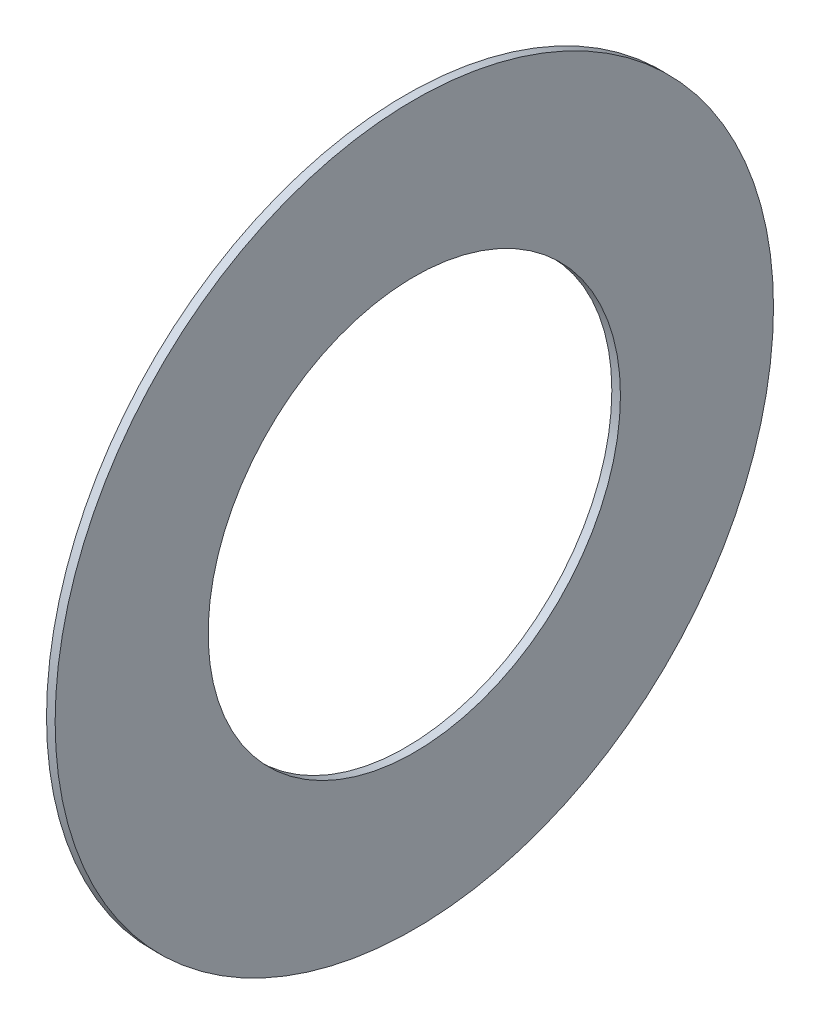
ISO-10303-21;
HEADER;
FILE_DESCRIPTION(('STEP AP214'),'2;1');
FILE_NAME('part.step','',(''),(''),'','','');
FILE_SCHEMA(('AUTOMOTIVE_DESIGN { 1 0 10303 214 1 1 1 1 }'));
ENDSEC;
DATA;
#1=APPLICATION_CONTEXT('core data for automotive mechanical design processes');
#2=APPLICATION_PROTOCOL_DEFINITION('international standard','automotive_design',2000,#1);
#3=PRODUCT_CONTEXT('',#1,'mechanical');
#4=PRODUCT('Part','Part','',(#3));
#5=PRODUCT_RELATED_PRODUCT_CATEGORY('part','',(#4));
#6=PRODUCT_DEFINITION_FORMATION('','',#4);
#7=PRODUCT_DEFINITION_CONTEXT('part definition',#1,'design');
#8=PRODUCT_DEFINITION('design','',#6,#7);
#9=PRODUCT_DEFINITION_SHAPE('','',#8);
#10=(LENGTH_UNIT() NAMED_UNIT(*) SI_UNIT(.MILLI.,.METRE.));
#11=(NAMED_UNIT(*) PLANE_ANGLE_UNIT() SI_UNIT($,.RADIAN.));
#12=(NAMED_UNIT(*) SI_UNIT($,.STERADIAN.) SOLID_ANGLE_UNIT());
#13=UNCERTAINTY_MEASURE_WITH_UNIT(LENGTH_MEASURE(1.E-05),#10,'distance_accuracy_value','');
#14=(GEOMETRIC_REPRESENTATION_CONTEXT(3) GLOBAL_UNCERTAINTY_ASSIGNED_CONTEXT((#13)) GLOBAL_UNIT_ASSIGNED_CONTEXT((#10,
#11,#12)) REPRESENTATION_CONTEXT('',''));
#15=CARTESIAN_POINT('',(0.,0.,0.));
#16=DIRECTION('',(0.,0.,1.));
#17=DIRECTION('',(1.,0.,0.));
#18=AXIS2_PLACEMENT_3D('',#15,#16,#17);
#19=CARTESIAN_POINT('',(0.276,6.6,0.));
#20=DIRECTION('',(1.,0.,0.));
#21=DIRECTION('',(0.,0.,-1.));
#22=AXIS2_PLACEMENT_3D('',#19,#20,#21);
#23=PLANE('',#22);
#24=CARTESIAN_POINT('',(0.276,0.,0.));
#25=DIRECTION('',(1.,0.,0.));
#26=DIRECTION('',(0.,0.,-1.));
#27=AXIS2_PLACEMENT_3D('',#24,#25,#26);
#28=CIRCLE('',#27,6.6);
#29=CARTESIAN_POINT('',(0.276,0.,-6.6));
#30=VERTEX_POINT('',#29);
#31=EDGE_CURVE('E26',#30,#30,#28,.F.);
#32=ORIENTED_EDGE('',*,*,#31,.T.);
#33=EDGE_LOOP('',(#32));
#34=FACE_BOUND('',#33,.T.);
#35=CARTESIAN_POINT('',(0.276,0.,0.));
#36=DIRECTION('',(1.,0.,0.));
#37=DIRECTION('',(0.,0.,-1.));
#38=AXIS2_PLACEMENT_3D('',#35,#36,#37);
#39=CIRCLE('',#38,11.5);
#40=CARTESIAN_POINT('',(0.276,0.,-11.5));
#41=VERTEX_POINT('',#40);
#42=EDGE_CURVE('E17',#41,#41,#39,.F.);
#43=ORIENTED_EDGE('',*,*,#42,.F.);
#44=EDGE_LOOP('',(#43));
#45=FACE_BOUND('',#44,.T.);
#46=ADVANCED_FACE('F14',(#34,#45),#23,.T.);
#47=CARTESIAN_POINT('',(0.138,0.,0.));
#48=DIRECTION('',(1.,0.,0.));
#49=DIRECTION('',(0.,0.,-1.));
#50=AXIS2_PLACEMENT_3D('',#47,#48,#49);
#51=CYLINDRICAL_SURFACE('',#50,11.5);
#52=CARTESIAN_POINT('',(0.,0.,0.));
#53=DIRECTION('',(1.,0.,0.));
#54=DIRECTION('',(0.,0.,-1.));
#55=AXIS2_PLACEMENT_3D('',#52,#53,#54);
#56=CIRCLE('',#55,11.5);
#57=CARTESIAN_POINT('',(0.,0.,-11.5));
#58=VERTEX_POINT('',#57);
#59=EDGE_CURVE('E21',#58,#58,#56,.F.);
#60=ORIENTED_EDGE('',*,*,#59,.F.);
#61=EDGE_LOOP('',(#60));
#62=FACE_BOUND('',#61,.T.);
#63=ORIENTED_EDGE('',*,*,#42,.T.);
#64=EDGE_LOOP('',(#63));
#65=FACE_BOUND('',#64,.T.);
#66=ADVANCED_FACE('F34',(#62,#65),#51,.T.);
#67=CARTESIAN_POINT('',(0.138,0.,0.));
#68=DIRECTION('',(1.,0.,0.));
#69=DIRECTION('',(0.,0.,-1.));
#70=AXIS2_PLACEMENT_3D('',#67,#68,#69);
#71=CYLINDRICAL_SURFACE('',#70,6.6);
#72=CARTESIAN_POINT('',(0.,0.,0.));
#73=DIRECTION('',(1.,0.,0.));
#74=DIRECTION('',(0.,0.,-1.));
#75=AXIS2_PLACEMENT_3D('',#72,#73,#74);
#76=CIRCLE('',#75,6.6);
#77=CARTESIAN_POINT('',(0.,0.,-6.6));
#78=VERTEX_POINT('',#77);
#79=EDGE_CURVE('E10',#78,#78,#76,.T.);
#80=ORIENTED_EDGE('',*,*,#79,.F.);
#81=EDGE_LOOP('',(#80));
#82=FACE_BOUND('',#81,.T.);
#83=ORIENTED_EDGE('',*,*,#31,.F.);
#84=EDGE_LOOP('',(#83));
#85=FACE_BOUND('',#84,.T.);
#86=ADVANCED_FACE('F41',(#82,#85),#71,.F.);
#87=CARTESIAN_POINT('',(0.,11.5,0.));
#88=DIRECTION('',(-1.,0.,0.));
#89=DIRECTION('',(0.,0.,1.));
#90=AXIS2_PLACEMENT_3D('',#87,#88,#89);
#91=PLANE('',#90);
#92=ORIENTED_EDGE('',*,*,#79,.T.);
#93=EDGE_LOOP('',(#92));
#94=FACE_BOUND('',#93,.T.);
#95=ORIENTED_EDGE('',*,*,#59,.T.);
#96=EDGE_LOOP('',(#95));
#97=FACE_BOUND('',#96,.T.);
#98=ADVANCED_FACE('F43',(#94,#97),#91,.T.);
#99=CLOSED_SHELL('',(#46,#66,#86,#98));
#100=MANIFOLD_SOLID_BREP('B1',#99);
#101=ADVANCED_BREP_SHAPE_REPRESENTATION('',(#18,#100),#14);
#102=SHAPE_DEFINITION_REPRESENTATION(#9,#101);
ENDSEC;
END-ISO-10303-21;
